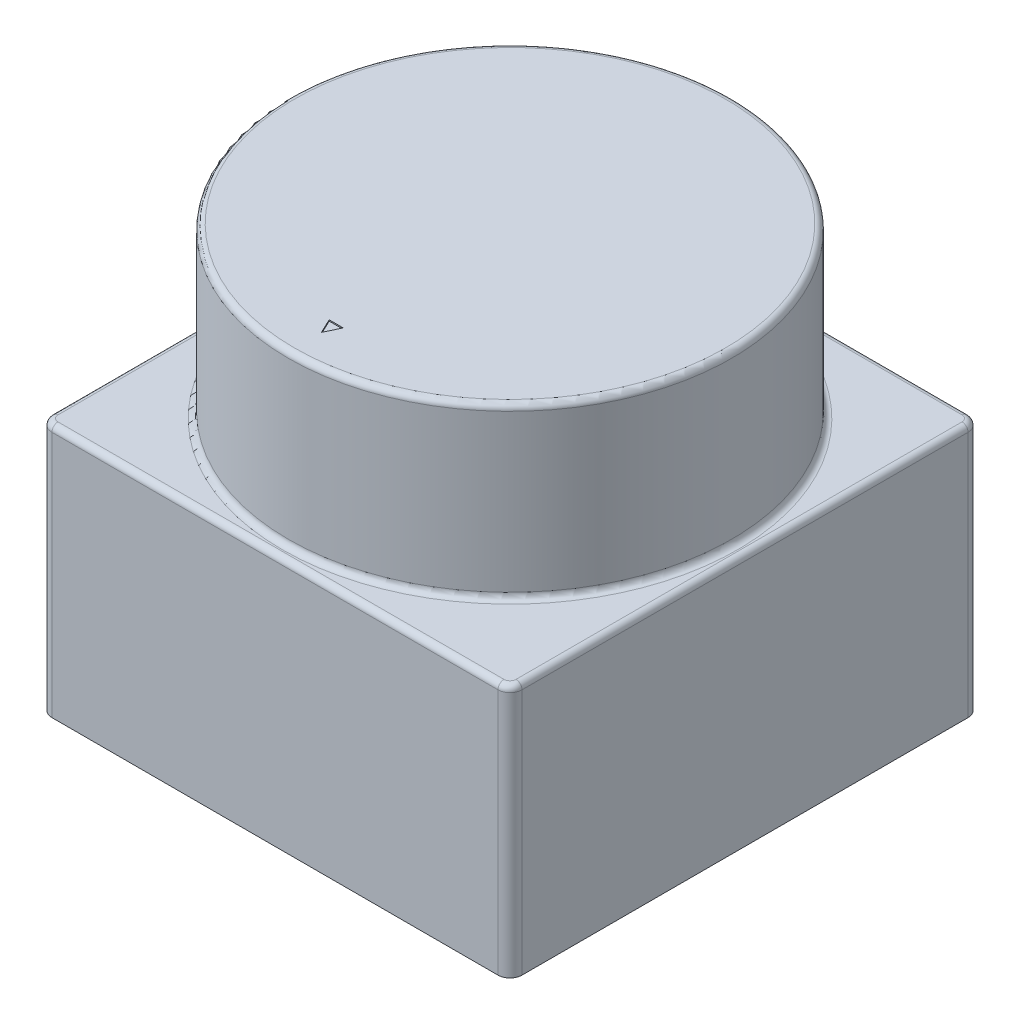
ISO-10303-21;
HEADER;
FILE_DESCRIPTION(('STEP AP214'),'2;1');
FILE_NAME('part.step','',(''),(''),'','','');
FILE_SCHEMA(('AUTOMOTIVE_DESIGN { 1 0 10303 214 1 1 1 1 }'));
ENDSEC;
DATA;
#1=APPLICATION_CONTEXT('core data for automotive mechanical design processes');
#2=APPLICATION_PROTOCOL_DEFINITION('international standard','automotive_design',2000,#1);
#3=PRODUCT_CONTEXT('',#1,'mechanical');
#4=PRODUCT('Part','Part','',(#3));
#5=PRODUCT_RELATED_PRODUCT_CATEGORY('part','',(#4));
#6=PRODUCT_DEFINITION_FORMATION('','',#4);
#7=PRODUCT_DEFINITION_CONTEXT('part definition',#1,'design');
#8=PRODUCT_DEFINITION('design','',#6,#7);
#9=PRODUCT_DEFINITION_SHAPE('','',#8);
#10=(LENGTH_UNIT() NAMED_UNIT(*) SI_UNIT(.MILLI.,.METRE.));
#11=(NAMED_UNIT(*) PLANE_ANGLE_UNIT() SI_UNIT($,.RADIAN.));
#12=(NAMED_UNIT(*) SI_UNIT($,.STERADIAN.) SOLID_ANGLE_UNIT());
#13=UNCERTAINTY_MEASURE_WITH_UNIT(LENGTH_MEASURE(1.E-05),#10,'distance_accuracy_value','');
#14=(GEOMETRIC_REPRESENTATION_CONTEXT(3) GLOBAL_UNCERTAINTY_ASSIGNED_CONTEXT((#13)) GLOBAL_UNIT_ASSIGNED_CONTEXT((#10,
#11,#12)) REPRESENTATION_CONTEXT('',''));
#15=CARTESIAN_POINT('',(0.,0.,0.));
#16=DIRECTION('',(0.,0.,1.));
#17=DIRECTION('',(1.,0.,0.));
#18=AXIS2_PLACEMENT_3D('',#15,#16,#17);
#19=CARTESIAN_POINT('',(19.5,21.,-19.5));
#20=DIRECTION('',(-1.,0.,0.));
#21=DIRECTION('',(0.,0.,1.));
#22=AXIS2_PLACEMENT_3D('',#19,#20,#21);
#23=PLANE('',#22);
#24=DIRECTION('',(0.,-1.,0.));
#25=VECTOR('',#24,1.);
#26=CARTESIAN_POINT('',(19.5,21.,-18.5));
#27=LINE('',#26,#25);
#28=CARTESIAN_POINT('',(19.5,0.,-18.5));
#29=VERTEX_POINT('',#28);
#30=CARTESIAN_POINT('',(19.5,20.5,-18.5));
#31=VERTEX_POINT('',#30);
#32=EDGE_CURVE('E240',#29,#31,#27,.F.);
#33=ORIENTED_EDGE('',*,*,#32,.T.);
#34=DIRECTION('',(0.,0.,-1.));
#35=VECTOR('',#34,1.);
#36=CARTESIAN_POINT('',(19.5,20.5,18.5));
#37=LINE('',#36,#35);
#38=CARTESIAN_POINT('',(19.5,20.5,18.5));
#39=VERTEX_POINT('',#38);
#40=EDGE_CURVE('E292',#31,#39,#37,.F.);
#41=ORIENTED_EDGE('',*,*,#40,.T.);
#42=DIRECTION('',(0.,-1.,0.));
#43=VECTOR('',#42,1.);
#44=CARTESIAN_POINT('',(19.5,21.,18.5));
#45=LINE('',#44,#43);
#46=CARTESIAN_POINT('',(19.5,0.,18.5));
#47=VERTEX_POINT('',#46);
#48=EDGE_CURVE('E244',#39,#47,#45,.T.);
#49=ORIENTED_EDGE('',*,*,#48,.T.);
#50=DIRECTION('',(0.,0.,-1.));
#51=VECTOR('',#50,1.);
#52=CARTESIAN_POINT('',(19.5,0.,-19.5));
#53=LINE('',#52,#51);
#54=EDGE_CURVE('E192',#47,#29,#53,.T.);
#55=ORIENTED_EDGE('',*,*,#54,.T.);
#56=EDGE_LOOP('',(#33,#41,#49,#55));
#57=FACE_BOUND('',#56,.T.);
#58=ADVANCED_FACE('F43',(#57),#23,.F.);
#59=CARTESIAN_POINT('',(-19.5,21.,-19.5));
#60=DIRECTION('',(0.,0.,1.));
#61=DIRECTION('',(1.,0.,0.));
#62=AXIS2_PLACEMENT_3D('',#59,#60,#61);
#63=PLANE('',#62);
#64=DIRECTION('',(0.,-1.,0.));
#65=VECTOR('',#64,1.);
#66=CARTESIAN_POINT('',(-18.5,21.,-19.5));
#67=LINE('',#66,#65);
#68=CARTESIAN_POINT('',(-18.5,0.,-19.5));
#69=VERTEX_POINT('',#68);
#70=CARTESIAN_POINT('',(-18.5,20.5,-19.5));
#71=VERTEX_POINT('',#70);
#72=EDGE_CURVE('E230',#69,#71,#67,.F.);
#73=ORIENTED_EDGE('',*,*,#72,.T.);
#74=DIRECTION('',(-1.,0.,0.));
#75=VECTOR('',#74,1.);
#76=CARTESIAN_POINT('',(18.5,20.5,-19.5));
#77=LINE('',#76,#75);
#78=CARTESIAN_POINT('',(18.5,20.5,-19.5));
#79=VERTEX_POINT('',#78);
#80=EDGE_CURVE('E11',#71,#79,#77,.F.);
#81=ORIENTED_EDGE('',*,*,#80,.T.);
#82=DIRECTION('',(0.,-1.,0.));
#83=VECTOR('',#82,1.);
#84=CARTESIAN_POINT('',(18.5,21.,-19.5));
#85=LINE('',#84,#83);
#86=CARTESIAN_POINT('',(18.5,0.,-19.5));
#87=VERTEX_POINT('',#86);
#88=EDGE_CURVE('E227',#79,#87,#85,.T.);
#89=ORIENTED_EDGE('',*,*,#88,.T.);
#90=DIRECTION('',(-1.,0.,0.));
#91=VECTOR('',#90,1.);
#92=CARTESIAN_POINT('',(-19.5,0.,-19.5));
#93=LINE('',#92,#91);
#94=EDGE_CURVE('E196',#87,#69,#93,.T.);
#95=ORIENTED_EDGE('',*,*,#94,.T.);
#96=EDGE_LOOP('',(#73,#81,#89,#95));
#97=FACE_BOUND('',#96,.T.);
#98=ADVANCED_FACE('F396',(#97),#63,.F.);
#99=CARTESIAN_POINT('',(-19.5,21.,-19.5));
#100=DIRECTION('',(1.,0.,0.));
#101=DIRECTION('',(0.,0.,-1.));
#102=AXIS2_PLACEMENT_3D('',#99,#100,#101);
#103=PLANE('',#102);
#104=DIRECTION('',(0.,-1.,0.));
#105=VECTOR('',#104,1.);
#106=CARTESIAN_POINT('',(-19.5,21.,18.5));
#107=LINE('',#106,#105);
#108=CARTESIAN_POINT('',(-19.5,0.,18.5));
#109=VERTEX_POINT('',#108);
#110=CARTESIAN_POINT('',(-19.5,20.5,18.5));
#111=VERTEX_POINT('',#110);
#112=EDGE_CURVE('E208',#109,#111,#107,.F.);
#113=ORIENTED_EDGE('',*,*,#112,.T.);
#114=DIRECTION('',(0.,0.,1.));
#115=VECTOR('',#114,1.);
#116=CARTESIAN_POINT('',(-19.5,20.5,-18.5));
#117=LINE('',#116,#115);
#118=CARTESIAN_POINT('',(-19.5,20.5,-18.5));
#119=VERTEX_POINT('',#118);
#120=EDGE_CURVE('E304',#111,#119,#117,.F.);
#121=ORIENTED_EDGE('',*,*,#120,.T.);
#122=DIRECTION('',(0.,-1.,0.));
#123=VECTOR('',#122,1.);
#124=CARTESIAN_POINT('',(-19.5,21.,-18.5));
#125=LINE('',#124,#123);
#126=CARTESIAN_POINT('',(-19.5,0.,-18.5));
#127=VERTEX_POINT('',#126);
#128=EDGE_CURVE('E212',#119,#127,#125,.T.);
#129=ORIENTED_EDGE('',*,*,#128,.T.);
#130=DIRECTION('',(0.,0.,1.));
#131=VECTOR('',#130,1.);
#132=CARTESIAN_POINT('',(-19.5,0.,-19.5));
#133=LINE('',#132,#131);
#134=EDGE_CURVE('E200',#127,#109,#133,.T.);
#135=ORIENTED_EDGE('',*,*,#134,.T.);
#136=EDGE_LOOP('',(#113,#121,#129,#135));
#137=FACE_BOUND('',#136,.T.);
#138=ADVANCED_FACE('F354',(#137),#103,.F.);
#139=CARTESIAN_POINT('',(-19.5,21.,19.5));
#140=DIRECTION('',(0.,0.,-1.));
#141=DIRECTION('',(-1.,0.,0.));
#142=AXIS2_PLACEMENT_3D('',#139,#140,#141);
#143=PLANE('',#142);
#144=DIRECTION('',(0.,-1.,0.));
#145=VECTOR('',#144,1.);
#146=CARTESIAN_POINT('',(18.5,21.,19.5));
#147=LINE('',#146,#145);
#148=CARTESIAN_POINT('',(18.5,0.,19.5));
#149=VERTEX_POINT('',#148);
#150=CARTESIAN_POINT('',(18.5,20.5,19.5));
#151=VERTEX_POINT('',#150);
#152=EDGE_CURVE('E233',#149,#151,#147,.F.);
#153=ORIENTED_EDGE('',*,*,#152,.T.);
#154=DIRECTION('',(1.,0.,0.));
#155=VECTOR('',#154,1.);
#156=CARTESIAN_POINT('',(-18.5,20.5,19.5));
#157=LINE('',#156,#155);
#158=CARTESIAN_POINT('',(-18.5,20.5,19.5));
#159=VERTEX_POINT('',#158);
#160=EDGE_CURVE('E298',#151,#159,#157,.F.);
#161=ORIENTED_EDGE('',*,*,#160,.T.);
#162=DIRECTION('',(0.,-1.,0.));
#163=VECTOR('',#162,1.);
#164=CARTESIAN_POINT('',(-18.5,21.,19.5));
#165=LINE('',#164,#163);
#166=CARTESIAN_POINT('',(-18.5,0.,19.5));
#167=VERTEX_POINT('',#166);
#168=EDGE_CURVE('E237',#159,#167,#165,.T.);
#169=ORIENTED_EDGE('',*,*,#168,.T.);
#170=DIRECTION('',(1.,0.,0.));
#171=VECTOR('',#170,1.);
#172=CARTESIAN_POINT('',(-19.5,0.,19.5));
#173=LINE('',#172,#171);
#174=EDGE_CURVE('E204',#167,#149,#173,.T.);
#175=ORIENTED_EDGE('',*,*,#174,.T.);
#176=EDGE_LOOP('',(#153,#161,#169,#175));
#177=FACE_BOUND('',#176,.T.);
#178=ADVANCED_FACE('F365',(#177),#143,.F.);
#179=CARTESIAN_POINT('',(0.,21.,0.));
#180=DIRECTION('',(0.,1.,0.));
#181=DIRECTION('',(0.,0.,1.));
#182=AXIS2_PLACEMENT_3D('',#179,#180,#181);
#183=PLANE('',#182);
#184=DIRECTION('',(0.,0.,-1.));
#185=VECTOR('',#184,1.);
#186=CARTESIAN_POINT('',(19.,21.,-18.5));
#187=LINE('',#186,#185);
#188=CARTESIAN_POINT('',(19.,21.,18.5));
#189=VERTEX_POINT('',#188);
#190=CARTESIAN_POINT('',(19.,21.,-18.5));
#191=VERTEX_POINT('',#190);
#192=EDGE_CURVE('E281',#189,#191,#187,.T.);
#193=ORIENTED_EDGE('',*,*,#192,.T.);
#194=CARTESIAN_POINT('',(18.5,21.,-18.5));
#195=DIRECTION('',(0.,1.,0.));
#196=DIRECTION('',(0.,0.,1.));
#197=AXIS2_PLACEMENT_3D('',#194,#195,#196);
#198=CIRCLE('',#197,0.5);
#199=CARTESIAN_POINT('',(18.5,21.,-19.));
#200=VERTEX_POINT('',#199);
#201=EDGE_CURVE('E284',#191,#200,#198,.T.);
#202=ORIENTED_EDGE('',*,*,#201,.T.);
#203=DIRECTION('',(-1.,0.,0.));
#204=VECTOR('',#203,1.);
#205=CARTESIAN_POINT('',(-18.5,21.,-19.));
#206=LINE('',#205,#204);
#207=CARTESIAN_POINT('',(-18.5,21.,-19.));
#208=VERTEX_POINT('',#207);
#209=EDGE_CURVE('E263',#200,#208,#206,.T.);
#210=ORIENTED_EDGE('',*,*,#209,.T.);
#211=CARTESIAN_POINT('',(-18.5,21.,-18.5));
#212=DIRECTION('',(0.,1.,0.));
#213=DIRECTION('',(0.,0.,1.));
#214=AXIS2_PLACEMENT_3D('',#211,#212,#213);
#215=CIRCLE('',#214,0.5);
#216=CARTESIAN_POINT('',(-19.,21.,-18.5));
#217=VERTEX_POINT('',#216);
#218=EDGE_CURVE('E266',#208,#217,#215,.T.);
#219=ORIENTED_EDGE('',*,*,#218,.T.);
#220=DIRECTION('',(0.,0.,1.));
#221=VECTOR('',#220,1.);
#222=CARTESIAN_POINT('',(-19.,21.,18.5));
#223=LINE('',#222,#221);
#224=CARTESIAN_POINT('',(-19.,21.,18.5));
#225=VERTEX_POINT('',#224);
#226=EDGE_CURVE('E269',#217,#225,#223,.T.);
#227=ORIENTED_EDGE('',*,*,#226,.T.);
#228=CARTESIAN_POINT('',(-18.5,21.,18.5));
#229=DIRECTION('',(0.,1.,0.));
#230=DIRECTION('',(0.,0.,1.));
#231=AXIS2_PLACEMENT_3D('',#228,#229,#230);
#232=CIRCLE('',#231,0.5);
#233=CARTESIAN_POINT('',(-18.5,21.,19.));
#234=VERTEX_POINT('',#233);
#235=EDGE_CURVE('E272',#225,#234,#232,.T.);
#236=ORIENTED_EDGE('',*,*,#235,.T.);
#237=DIRECTION('',(1.,0.,0.));
#238=VECTOR('',#237,1.);
#239=CARTESIAN_POINT('',(18.5,21.,19.));
#240=LINE('',#239,#238);
#241=CARTESIAN_POINT('',(18.5,21.,19.));
#242=VERTEX_POINT('',#241);
#243=EDGE_CURVE('E275',#234,#242,#240,.T.);
#244=ORIENTED_EDGE('',*,*,#243,.T.);
#245=CARTESIAN_POINT('',(18.5,21.,18.5));
#246=DIRECTION('',(0.,1.,0.));
#247=DIRECTION('',(0.,0.,1.));
#248=AXIS2_PLACEMENT_3D('',#245,#246,#247);
#249=CIRCLE('',#248,0.5);
#250=EDGE_CURVE('E278',#242,#189,#249,.T.);
#251=ORIENTED_EDGE('',*,*,#250,.T.);
#252=EDGE_LOOP('',(#193,#202,#210,#219,#227,#236,#244,#251));
#253=FACE_BOUND('',#252,.T.);
#254=CARTESIAN_POINT('',(0.,21.,0.));
#255=DIRECTION('',(0.,1.,0.));
#256=DIRECTION('',(0.,0.,1.));
#257=AXIS2_PLACEMENT_3D('',#254,#255,#256);
#258=CIRCLE('',#257,18.8809971304255);
#259=CARTESIAN_POINT('',(0.,21.,18.8809971304255));
#260=VERTEX_POINT('',#259);
#261=EDGE_CURVE('E259',#260,#260,#258,.F.);
#262=ORIENTED_EDGE('',*,*,#261,.T.);
#263=EDGE_LOOP('',(#262));
#264=FACE_BOUND('',#263,.T.);
#265=ADVANCED_FACE('F381',(#253,#264),#183,.T.);
#266=CARTESIAN_POINT('',(0.,0.,0.));
#267=DIRECTION('',(0.,1.,0.));
#268=DIRECTION('',(0.,0.,1.));
#269=AXIS2_PLACEMENT_3D('',#266,#267,#268);
#270=PLANE('',#269);
#271=ORIENTED_EDGE('',*,*,#134,.F.);
#272=CARTESIAN_POINT('',(-18.5,0.,-18.5));
#273=DIRECTION('',(0.,1.,0.));
#274=DIRECTION('',(0.,0.,1.));
#275=AXIS2_PLACEMENT_3D('',#272,#273,#274);
#276=CIRCLE('',#275,1.);
#277=EDGE_CURVE('E224',#127,#69,#276,.F.);
#278=ORIENTED_EDGE('',*,*,#277,.T.);
#279=ORIENTED_EDGE('',*,*,#94,.F.);
#280=CARTESIAN_POINT('',(18.5,0.,-18.5));
#281=DIRECTION('',(0.,1.,0.));
#282=DIRECTION('',(0.,0.,1.));
#283=AXIS2_PLACEMENT_3D('',#280,#281,#282);
#284=CIRCLE('',#283,1.);
#285=EDGE_CURVE('E215',#87,#29,#284,.F.);
#286=ORIENTED_EDGE('',*,*,#285,.T.);
#287=ORIENTED_EDGE('',*,*,#54,.F.);
#288=CARTESIAN_POINT('',(18.5,0.,18.5));
#289=DIRECTION('',(0.,1.,0.));
#290=DIRECTION('',(0.,0.,1.));
#291=AXIS2_PLACEMENT_3D('',#288,#289,#290);
#292=CIRCLE('',#291,1.);
#293=EDGE_CURVE('E218',#47,#149,#292,.F.);
#294=ORIENTED_EDGE('',*,*,#293,.T.);
#295=ORIENTED_EDGE('',*,*,#174,.F.);
#296=CARTESIAN_POINT('',(-18.5,0.,18.5));
#297=DIRECTION('',(0.,1.,0.));
#298=DIRECTION('',(0.,0.,1.));
#299=AXIS2_PLACEMENT_3D('',#296,#297,#298);
#300=CIRCLE('',#299,1.);
#301=EDGE_CURVE('E221',#167,#109,#300,.F.);
#302=ORIENTED_EDGE('',*,*,#301,.T.);
#303=EDGE_LOOP('',(#271,#278,#279,#286,#287,#294,#295,#302));
#304=FACE_BOUND('',#303,.T.);
#305=ADVANCED_FACE('F358',(#304),#270,.F.);
#306=CARTESIAN_POINT('',(0.,35.,0.));
#307=DIRECTION('',(0.,-1.,0.));
#308=DIRECTION('',(0.,0.,-1.));
#309=AXIS2_PLACEMENT_3D('',#306,#307,#308);
#310=CYLINDRICAL_SURFACE('',#309,18.3809971304255);
#311=CARTESIAN_POINT('',(0.,34.5,0.));
#312=DIRECTION('',(0.,1.,0.));
#313=DIRECTION('',(0.,0.,1.));
#314=AXIS2_PLACEMENT_3D('',#311,#312,#313);
#315=CIRCLE('',#314,18.3809971304255);
#316=CARTESIAN_POINT('',(0.,34.5,18.3809971304255));
#317=VERTEX_POINT('',#316);
#318=EDGE_CURVE('E255',#317,#317,#315,.F.);
#319=ORIENTED_EDGE('',*,*,#318,.T.);
#320=EDGE_LOOP('',(#319));
#321=FACE_BOUND('',#320,.T.);
#322=CARTESIAN_POINT('',(0.,21.5,0.));
#323=DIRECTION('',(0.,1.,0.));
#324=DIRECTION('',(0.,0.,1.));
#325=AXIS2_PLACEMENT_3D('',#322,#323,#324);
#326=CIRCLE('',#325,18.3809971304255);
#327=CARTESIAN_POINT('',(0.,21.5,18.3809971304255));
#328=VERTEX_POINT('',#327);
#329=EDGE_CURVE('E251',#328,#328,#326,.T.);
#330=ORIENTED_EDGE('',*,*,#329,.T.);
#331=EDGE_LOOP('',(#330));
#332=FACE_BOUND('',#331,.T.);
#333=ADVANCED_FACE('F442',(#321,#332),#310,.T.);
#334=CARTESIAN_POINT('',(0.,35.,0.));
#335=DIRECTION('',(0.,1.,0.));
#336=DIRECTION('',(0.,0.,1.));
#337=AXIS2_PLACEMENT_3D('',#334,#335,#336);
#338=PLANE('',#337);
#339=DIRECTION('',(0.4292993742117,0.,-0.903162248602898));
#340=VECTOR('',#339,1.);
#341=CARTESIAN_POINT('',(0.583250004371816,35.,14.4175551774008));
#342=LINE('',#341,#340);
#343=CARTESIAN_POINT('',(0.,35.,15.6445995596886));
#344=VERTEX_POINT('',#343);
#345=CARTESIAN_POINT('',(0.583250004371816,35.,14.4175551774008));
#346=VERTEX_POINT('',#345);
#347=EDGE_CURVE('E61',#344,#346,#342,.T.);
#348=ORIENTED_EDGE('',*,*,#347,.F.);
#349=DIRECTION('',(0.4292993742117,0.,0.903162248602898));
#350=VECTOR('',#349,1.);
#351=CARTESIAN_POINT('',(0.,35.,15.6445995596886));
#352=LINE('',#351,#350);
#353=CARTESIAN_POINT('',(-0.583250004371816,35.,14.4175551774008));
#354=VERTEX_POINT('',#353);
#355=EDGE_CURVE('E173',#354,#344,#352,.T.);
#356=ORIENTED_EDGE('',*,*,#355,.F.);
#357=DIRECTION('',(-1.,0.,0.));
#358=VECTOR('',#357,1.);
#359=CARTESIAN_POINT('',(-0.583250004371816,35.,14.4175551774008));
#360=LINE('',#359,#358);
#361=EDGE_CURVE('E177',#346,#354,#360,.T.);
#362=ORIENTED_EDGE('',*,*,#361,.F.);
#363=EDGE_LOOP('',(#348,#356,#362));
#364=FACE_BOUND('',#363,.T.);
#365=CARTESIAN_POINT('',(0.,35.,0.));
#366=DIRECTION('',(0.,1.,0.));
#367=DIRECTION('',(0.,0.,1.));
#368=AXIS2_PLACEMENT_3D('',#365,#366,#367);
#369=CIRCLE('',#368,17.8809971304255);
#370=CARTESIAN_POINT('',(0.,35.,17.8809971304255));
#371=VERTEX_POINT('',#370);
#372=EDGE_CURVE('E247',#371,#371,#369,.T.);
#373=ORIENTED_EDGE('',*,*,#372,.T.);
#374=EDGE_LOOP('',(#373));
#375=FACE_BOUND('',#374,.T.);
#376=ADVANCED_FACE('F425',(#364,#375),#338,.T.);
#377=CARTESIAN_POINT('',(-18.5,21.,-18.5));
#378=DIRECTION('',(0.,-1.,0.));
#379=DIRECTION('',(0.,0.,-1.));
#380=AXIS2_PLACEMENT_3D('',#377,#378,#379);
#381=CYLINDRICAL_SURFACE('',#380,1.);
#382=ORIENTED_EDGE('',*,*,#128,.F.);
#383=CARTESIAN_POINT('',(-18.5,20.5,-18.5));
#384=DIRECTION('',(0.,1.,0.));
#385=DIRECTION('',(0.,0.,1.));
#386=AXIS2_PLACEMENT_3D('',#383,#384,#385);
#387=CIRCLE('',#386,1.);
#388=EDGE_CURVE('E53',#119,#71,#387,.F.);
#389=ORIENTED_EDGE('',*,*,#388,.T.);
#390=ORIENTED_EDGE('',*,*,#72,.F.);
#391=ORIENTED_EDGE('',*,*,#277,.F.);
#392=EDGE_LOOP('',(#382,#389,#390,#391));
#393=FACE_BOUND('',#392,.T.);
#394=ADVANCED_FACE('F422',(#393),#381,.T.);
#395=CARTESIAN_POINT('',(-18.5,21.,18.5));
#396=DIRECTION('',(0.,-1.,0.));
#397=DIRECTION('',(0.,0.,-1.));
#398=AXIS2_PLACEMENT_3D('',#395,#396,#397);
#399=CYLINDRICAL_SURFACE('',#398,1.);
#400=ORIENTED_EDGE('',*,*,#168,.F.);
#401=CARTESIAN_POINT('',(-18.5,20.5,18.5));
#402=DIRECTION('',(0.,1.,0.));
#403=DIRECTION('',(0.,0.,1.));
#404=AXIS2_PLACEMENT_3D('',#401,#402,#403);
#405=CIRCLE('',#404,1.);
#406=EDGE_CURVE('E301',#159,#111,#405,.F.);
#407=ORIENTED_EDGE('',*,*,#406,.T.);
#408=ORIENTED_EDGE('',*,*,#112,.F.);
#409=ORIENTED_EDGE('',*,*,#301,.F.);
#410=EDGE_LOOP('',(#400,#407,#408,#409));
#411=FACE_BOUND('',#410,.T.);
#412=ADVANCED_FACE('F351',(#411),#399,.T.);
#413=CARTESIAN_POINT('',(18.5,21.,18.5));
#414=DIRECTION('',(0.,-1.,0.));
#415=DIRECTION('',(0.,0.,-1.));
#416=AXIS2_PLACEMENT_3D('',#413,#414,#415);
#417=CYLINDRICAL_SURFACE('',#416,1.);
#418=ORIENTED_EDGE('',*,*,#48,.F.);
#419=CARTESIAN_POINT('',(18.5,20.5,18.5));
#420=DIRECTION('',(0.,1.,0.));
#421=DIRECTION('',(0.,0.,1.));
#422=AXIS2_PLACEMENT_3D('',#419,#420,#421);
#423=CIRCLE('',#422,1.);
#424=EDGE_CURVE('E295',#39,#151,#423,.F.);
#425=ORIENTED_EDGE('',*,*,#424,.T.);
#426=ORIENTED_EDGE('',*,*,#152,.F.);
#427=ORIENTED_EDGE('',*,*,#293,.F.);
#428=EDGE_LOOP('',(#418,#425,#426,#427));
#429=FACE_BOUND('',#428,.T.);
#430=ADVANCED_FACE('F368',(#429),#417,.T.);
#431=CARTESIAN_POINT('',(18.5,21.,-18.5));
#432=DIRECTION('',(0.,-1.,0.));
#433=DIRECTION('',(0.,0.,-1.));
#434=AXIS2_PLACEMENT_3D('',#431,#432,#433);
#435=CYLINDRICAL_SURFACE('',#434,1.);
#436=ORIENTED_EDGE('',*,*,#88,.F.);
#437=CARTESIAN_POINT('',(18.5,20.5,-18.5));
#438=DIRECTION('',(0.,1.,0.));
#439=DIRECTION('',(0.,0.,1.));
#440=AXIS2_PLACEMENT_3D('',#437,#438,#439);
#441=CIRCLE('',#440,1.);
#442=EDGE_CURVE('E288',#79,#31,#441,.F.);
#443=ORIENTED_EDGE('',*,*,#442,.T.);
#444=ORIENTED_EDGE('',*,*,#32,.F.);
#445=ORIENTED_EDGE('',*,*,#285,.F.);
#446=EDGE_LOOP('',(#436,#443,#444,#445));
#447=FACE_BOUND('',#446,.T.);
#448=ADVANCED_FACE('F400',(#447),#435,.T.);
#449=CARTESIAN_POINT('',(0.,34.5,0.));
#450=DIRECTION('',(0.,1.,0.));
#451=DIRECTION('',(0.,0.,1.));
#452=AXIS2_PLACEMENT_3D('',#449,#450,#451);
#453=TOROIDAL_SURFACE('',#452,17.8809971304255,0.5);
#454=ORIENTED_EDGE('',*,*,#318,.F.);
#455=EDGE_LOOP('',(#454));
#456=FACE_BOUND('',#455,.T.);
#457=ORIENTED_EDGE('',*,*,#372,.F.);
#458=EDGE_LOOP('',(#457));
#459=FACE_BOUND('',#458,.T.);
#460=ADVANCED_FACE('F431',(#456,#459),#453,.T.);
#461=CARTESIAN_POINT('',(-18.5,20.5,18.5));
#462=DIRECTION('',(0.,1.,0.));
#463=DIRECTION('',(0.,0.,1.));
#464=AXIS2_PLACEMENT_3D('',#461,#462,#463);
#465=DEGENERATE_TOROIDAL_SURFACE('',#464,0.5,0.5,.T.);
#466=CARTESIAN_POINT('',(-19.,20.5,18.5));
#467=DIRECTION('',(0.,0.,-1.));
#468=DIRECTION('',(-1.,0.,0.));
#469=AXIS2_PLACEMENT_3D('',#466,#467,#468);
#470=CIRCLE('',#469,0.5);
#471=EDGE_CURVE('E329',#111,#225,#470,.T.);
#472=ORIENTED_EDGE('',*,*,#471,.F.);
#473=ORIENTED_EDGE('',*,*,#406,.F.);
#474=CARTESIAN_POINT('',(-18.5,20.5,19.));
#475=DIRECTION('',(1.,0.,0.));
#476=DIRECTION('',(0.,0.,-1.));
#477=AXIS2_PLACEMENT_3D('',#474,#475,#476);
#478=CIRCLE('',#477,0.5);
#479=EDGE_CURVE('E47',#234,#159,#478,.T.);
#480=ORIENTED_EDGE('',*,*,#479,.F.);
#481=ORIENTED_EDGE('',*,*,#235,.F.);
#482=EDGE_LOOP('',(#472,#473,#480,#481));
#483=FACE_BOUND('',#482,.T.);
#484=ADVANCED_FACE('F347',(#483),#465,.T.);
#485=CARTESIAN_POINT('',(0.,20.5,19.));
#486=DIRECTION('',(-1.,0.,0.));
#487=DIRECTION('',(0.,0.,1.));
#488=AXIS2_PLACEMENT_3D('',#485,#486,#487);
#489=CYLINDRICAL_SURFACE('',#488,0.5);
#490=ORIENTED_EDGE('',*,*,#479,.T.);
#491=ORIENTED_EDGE('',*,*,#160,.F.);
#492=CARTESIAN_POINT('',(18.5,20.5,19.));
#493=DIRECTION('',(1.,0.,0.));
#494=DIRECTION('',(0.,0.,-1.));
#495=AXIS2_PLACEMENT_3D('',#492,#493,#494);
#496=CIRCLE('',#495,0.5);
#497=EDGE_CURVE('E326',#242,#151,#496,.T.);
#498=ORIENTED_EDGE('',*,*,#497,.F.);
#499=ORIENTED_EDGE('',*,*,#243,.F.);
#500=EDGE_LOOP('',(#490,#491,#498,#499));
#501=FACE_BOUND('',#500,.T.);
#502=ADVANCED_FACE('F342',(#501),#489,.T.);
#503=CARTESIAN_POINT('',(-19.,20.5,0.));
#504=DIRECTION('',(0.,0.,-1.));
#505=DIRECTION('',(-1.,0.,0.));
#506=AXIS2_PLACEMENT_3D('',#503,#504,#505);
#507=CYLINDRICAL_SURFACE('',#506,0.5);
#508=ORIENTED_EDGE('',*,*,#471,.T.);
#509=ORIENTED_EDGE('',*,*,#226,.F.);
#510=CARTESIAN_POINT('',(-19.,20.5,-18.5));
#511=DIRECTION('',(0.,0.,-1.));
#512=DIRECTION('',(-1.,0.,0.));
#513=AXIS2_PLACEMENT_3D('',#510,#511,#512);
#514=CIRCLE('',#513,0.5);
#515=EDGE_CURVE('E322',#119,#217,#514,.T.);
#516=ORIENTED_EDGE('',*,*,#515,.F.);
#517=ORIENTED_EDGE('',*,*,#120,.F.);
#518=EDGE_LOOP('',(#508,#509,#516,#517));
#519=FACE_BOUND('',#518,.T.);
#520=ADVANCED_FACE('F385',(#519),#507,.T.);
#521=CARTESIAN_POINT('',(18.5,20.5,18.5));
#522=DIRECTION('',(0.,1.,0.));
#523=DIRECTION('',(0.,0.,1.));
#524=AXIS2_PLACEMENT_3D('',#521,#522,#523);
#525=DEGENERATE_TOROIDAL_SURFACE('',#524,0.5,0.5,.T.);
#526=ORIENTED_EDGE('',*,*,#497,.T.);
#527=ORIENTED_EDGE('',*,*,#424,.F.);
#528=CARTESIAN_POINT('',(19.,20.5,18.5));
#529=DIRECTION('',(0.,0.,-1.));
#530=DIRECTION('',(-1.,0.,0.));
#531=AXIS2_PLACEMENT_3D('',#528,#529,#530);
#532=CIRCLE('',#531,0.5);
#533=EDGE_CURVE('E318',#189,#39,#532,.T.);
#534=ORIENTED_EDGE('',*,*,#533,.F.);
#535=ORIENTED_EDGE('',*,*,#250,.F.);
#536=EDGE_LOOP('',(#526,#527,#534,#535));
#537=FACE_BOUND('',#536,.T.);
#538=ADVANCED_FACE('F372',(#537),#525,.T.);
#539=CARTESIAN_POINT('',(-18.5,20.5,-18.5));
#540=DIRECTION('',(0.,1.,0.));
#541=DIRECTION('',(0.,0.,1.));
#542=AXIS2_PLACEMENT_3D('',#539,#540,#541);
#543=DEGENERATE_TOROIDAL_SURFACE('',#542,0.5,0.5,.T.);
#544=ORIENTED_EDGE('',*,*,#515,.T.);
#545=ORIENTED_EDGE('',*,*,#218,.F.);
#546=CARTESIAN_POINT('',(-18.5,20.5,-19.));
#547=DIRECTION('',(1.,0.,0.));
#548=DIRECTION('',(0.,0.,-1.));
#549=AXIS2_PLACEMENT_3D('',#546,#547,#548);
#550=CIRCLE('',#549,0.5);
#551=EDGE_CURVE('E314',#71,#208,#550,.T.);
#552=ORIENTED_EDGE('',*,*,#551,.F.);
#553=ORIENTED_EDGE('',*,*,#388,.F.);
#554=EDGE_LOOP('',(#544,#545,#552,#553));
#555=FACE_BOUND('',#554,.T.);
#556=ADVANCED_FACE('F387',(#555),#543,.T.);
#557=CARTESIAN_POINT('',(19.,20.5,0.));
#558=DIRECTION('',(0.,0.,1.));
#559=DIRECTION('',(1.,0.,0.));
#560=AXIS2_PLACEMENT_3D('',#557,#558,#559);
#561=CYLINDRICAL_SURFACE('',#560,0.5);
#562=ORIENTED_EDGE('',*,*,#533,.T.);
#563=ORIENTED_EDGE('',*,*,#40,.F.);
#564=CARTESIAN_POINT('',(19.,20.5,-18.5));
#565=DIRECTION('',(0.,0.,-1.));
#566=DIRECTION('',(-1.,0.,0.));
#567=AXIS2_PLACEMENT_3D('',#564,#565,#566);
#568=CIRCLE('',#567,0.5);
#569=EDGE_CURVE('E311',#191,#31,#568,.T.);
#570=ORIENTED_EDGE('',*,*,#569,.F.);
#571=ORIENTED_EDGE('',*,*,#192,.F.);
#572=EDGE_LOOP('',(#562,#563,#570,#571));
#573=FACE_BOUND('',#572,.T.);
#574=ADVANCED_FACE('F377',(#573),#561,.T.);
#575=CARTESIAN_POINT('',(0.,20.5,-19.));
#576=DIRECTION('',(1.,0.,0.));
#577=DIRECTION('',(0.,0.,-1.));
#578=AXIS2_PLACEMENT_3D('',#575,#576,#577);
#579=CYLINDRICAL_SURFACE('',#578,0.5);
#580=ORIENTED_EDGE('',*,*,#551,.T.);
#581=ORIENTED_EDGE('',*,*,#209,.F.);
#582=CARTESIAN_POINT('',(18.5,20.5,-19.));
#583=DIRECTION('',(1.,0.,0.));
#584=DIRECTION('',(0.,0.,-1.));
#585=AXIS2_PLACEMENT_3D('',#582,#583,#584);
#586=CIRCLE('',#585,0.5);
#587=EDGE_CURVE('E189',#79,#200,#586,.T.);
#588=ORIENTED_EDGE('',*,*,#587,.F.);
#589=ORIENTED_EDGE('',*,*,#80,.F.);
#590=EDGE_LOOP('',(#580,#581,#588,#589));
#591=FACE_BOUND('',#590,.T.);
#592=ADVANCED_FACE('F393',(#591),#579,.T.);
#593=CARTESIAN_POINT('',(18.5,20.5,-18.5));
#594=DIRECTION('',(0.,1.,0.));
#595=DIRECTION('',(0.,0.,1.));
#596=AXIS2_PLACEMENT_3D('',#593,#594,#595);
#597=DEGENERATE_TOROIDAL_SURFACE('',#596,0.5,0.5,.T.);
#598=ORIENTED_EDGE('',*,*,#569,.T.);
#599=ORIENTED_EDGE('',*,*,#442,.F.);
#600=ORIENTED_EDGE('',*,*,#587,.T.);
#601=ORIENTED_EDGE('',*,*,#201,.F.);
#602=EDGE_LOOP('',(#598,#599,#600,#601));
#603=FACE_BOUND('',#602,.T.);
#604=ADVANCED_FACE('F403',(#603),#597,.T.);
#605=CARTESIAN_POINT('',(0.,21.5,0.));
#606=DIRECTION('',(0.,1.,0.));
#607=DIRECTION('',(0.,0.,1.));
#608=AXIS2_PLACEMENT_3D('',#605,#606,#607);
#609=TOROIDAL_SURFACE('',#608,18.8809971304255,0.5);
#610=ORIENTED_EDGE('',*,*,#261,.F.);
#611=EDGE_LOOP('',(#610));
#612=FACE_BOUND('',#611,.T.);
#613=ORIENTED_EDGE('',*,*,#329,.F.);
#614=EDGE_LOOP('',(#613));
#615=FACE_BOUND('',#614,.T.);
#616=ADVANCED_FACE('F45',(#612,#615),#609,.F.);
#617=CARTESIAN_POINT('',(0.583250004371816,34.9,14.4175551774008));
#618=DIRECTION('',(0.903162248602898,0.,0.4292993742117));
#619=DIRECTION('',(0.4292993742117,0.,-0.903162248602898));
#620=AXIS2_PLACEMENT_3D('',#617,#618,#619);
#621=PLANE('',#620);
#622=ORIENTED_EDGE('',*,*,#347,.T.);
#623=DIRECTION('',(0.,1.,0.));
#624=VECTOR('',#623,1.);
#625=CARTESIAN_POINT('',(0.583250004371816,34.9,14.4175551774008));
#626=LINE('',#625,#624);
#627=CARTESIAN_POINT('',(0.583250004371816,34.9,14.4175551774008));
#628=VERTEX_POINT('',#627);
#629=EDGE_CURVE('E151',#628,#346,#626,.T.);
#630=ORIENTED_EDGE('',*,*,#629,.F.);
#631=DIRECTION('',(0.4292993742117,0.,-0.903162248602898));
#632=VECTOR('',#631,1.);
#633=CARTESIAN_POINT('',(0.583250004371816,34.9,14.4175551774008));
#634=LINE('',#633,#632);
#635=CARTESIAN_POINT('',(0.,34.9,15.6445995596886));
#636=VERTEX_POINT('',#635);
#637=EDGE_CURVE('E155',#636,#628,#634,.T.);
#638=ORIENTED_EDGE('',*,*,#637,.F.);
#639=DIRECTION('',(0.,1.,0.));
#640=VECTOR('',#639,1.);
#641=CARTESIAN_POINT('',(0.,34.9,15.6445995596886));
#642=LINE('',#641,#640);
#643=EDGE_CURVE('E186',#636,#344,#642,.T.);
#644=ORIENTED_EDGE('',*,*,#643,.T.);
#645=EDGE_LOOP('',(#622,#630,#638,#644));
#646=FACE_BOUND('',#645,.T.);
#647=ADVANCED_FACE('F153',(#646),#621,.F.);
#648=CARTESIAN_POINT('',(0.,34.9,15.6445995596886));
#649=DIRECTION('',(-0.903162248602898,0.,0.4292993742117));
#650=DIRECTION('',(0.4292993742117,0.,0.903162248602898));
#651=AXIS2_PLACEMENT_3D('',#648,#649,#650);
#652=PLANE('',#651);
#653=ORIENTED_EDGE('',*,*,#355,.T.);
#654=ORIENTED_EDGE('',*,*,#643,.F.);
#655=DIRECTION('',(0.4292993742117,0.,0.903162248602898));
#656=VECTOR('',#655,1.);
#657=CARTESIAN_POINT('',(0.,34.9,15.6445995596886));
#658=LINE('',#657,#656);
#659=CARTESIAN_POINT('',(-0.583250004371816,34.9,14.4175551774008));
#660=VERTEX_POINT('',#659);
#661=EDGE_CURVE('E162',#660,#636,#658,.T.);
#662=ORIENTED_EDGE('',*,*,#661,.F.);
#663=DIRECTION('',(0.,1.,0.));
#664=VECTOR('',#663,1.);
#665=CARTESIAN_POINT('',(-0.583250004371816,34.9,14.4175551774008));
#666=LINE('',#665,#664);
#667=EDGE_CURVE('E161',#660,#354,#666,.T.);
#668=ORIENTED_EDGE('',*,*,#667,.T.);
#669=EDGE_LOOP('',(#653,#654,#662,#668));
#670=FACE_BOUND('',#669,.T.);
#671=ADVANCED_FACE('F496',(#670),#652,.F.);
#672=CARTESIAN_POINT('',(-0.583250004371816,34.9,14.4175551774008));
#673=DIRECTION('',(0.,0.,-1.));
#674=DIRECTION('',(-1.,0.,0.));
#675=AXIS2_PLACEMENT_3D('',#672,#673,#674);
#676=PLANE('',#675);
#677=ORIENTED_EDGE('',*,*,#361,.T.);
#678=ORIENTED_EDGE('',*,*,#667,.F.);
#679=DIRECTION('',(-1.,0.,0.));
#680=VECTOR('',#679,1.);
#681=CARTESIAN_POINT('',(-0.583250004371816,34.9,14.4175551774008));
#682=LINE('',#681,#680);
#683=EDGE_CURVE('E165',#628,#660,#682,.T.);
#684=ORIENTED_EDGE('',*,*,#683,.F.);
#685=ORIENTED_EDGE('',*,*,#629,.T.);
#686=EDGE_LOOP('',(#677,#678,#684,#685));
#687=FACE_BOUND('',#686,.T.);
#688=ADVANCED_FACE('F166',(#687),#676,.F.);
#689=CARTESIAN_POINT('',(0.,34.9,0.));
#690=DIRECTION('',(0.,1.,0.));
#691=DIRECTION('',(0.,0.,1.));
#692=AXIS2_PLACEMENT_3D('',#689,#690,#691);
#693=PLANE('',#692);
#694=ORIENTED_EDGE('',*,*,#637,.T.);
#695=ORIENTED_EDGE('',*,*,#683,.T.);
#696=ORIENTED_EDGE('',*,*,#661,.T.);
#697=EDGE_LOOP('',(#694,#695,#696));
#698=FACE_BOUND('',#697,.T.);
#699=ADVANCED_FACE('F171',(#698),#693,.T.);
#700=CLOSED_SHELL('',(#58,#98,#138,#178,#265,#305,#333,#376,#394,#412,#430,#448,#460,#484,#502,
#520,#538,#556,#574,#592,#604,#616,#647,#671,#688,#699));
#701=MANIFOLD_SOLID_BREP('B2',#700);
#702=ADVANCED_BREP_SHAPE_REPRESENTATION('',(#18,#701),#14);
#703=SHAPE_DEFINITION_REPRESENTATION(#9,#702);
ENDSEC;
END-ISO-10303-21;
